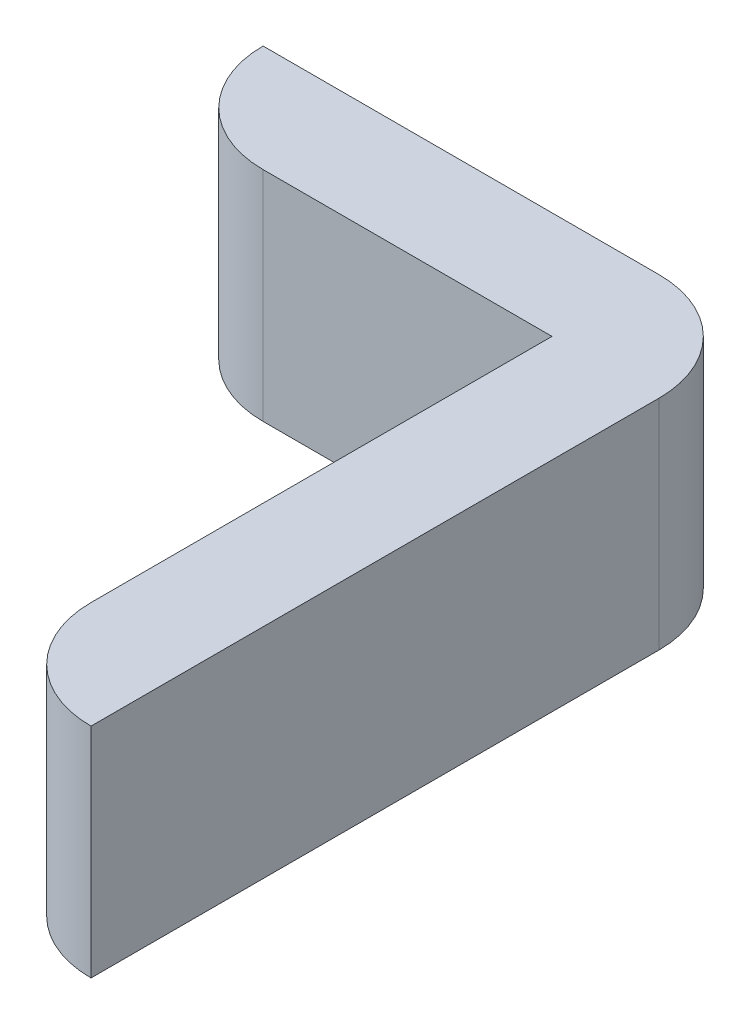
ISO-10303-21;
HEADER;
FILE_DESCRIPTION(('STEP AP214'),'2;1');
FILE_NAME('part.step','',(''),(''),'','','');
FILE_SCHEMA(('AUTOMOTIVE_DESIGN { 1 0 10303 214 1 1 1 1 }'));
ENDSEC;
DATA;
#1=APPLICATION_CONTEXT('core data for automotive mechanical design processes');
#2=APPLICATION_PROTOCOL_DEFINITION('international standard','automotive_design',2000,#1);
#3=PRODUCT_CONTEXT('',#1,'mechanical');
#4=PRODUCT('Part','Part','',(#3));
#5=PRODUCT_RELATED_PRODUCT_CATEGORY('part','',(#4));
#6=PRODUCT_DEFINITION_FORMATION('','',#4);
#7=PRODUCT_DEFINITION_CONTEXT('part definition',#1,'design');
#8=PRODUCT_DEFINITION('design','',#6,#7);
#9=PRODUCT_DEFINITION_SHAPE('','',#8);
#10=(LENGTH_UNIT() NAMED_UNIT(*) SI_UNIT(.MILLI.,.METRE.));
#11=(NAMED_UNIT(*) PLANE_ANGLE_UNIT() SI_UNIT($,.RADIAN.));
#12=(NAMED_UNIT(*) SI_UNIT($,.STERADIAN.) SOLID_ANGLE_UNIT());
#13=UNCERTAINTY_MEASURE_WITH_UNIT(LENGTH_MEASURE(1.E-05),#10,'distance_accuracy_value','');
#14=(GEOMETRIC_REPRESENTATION_CONTEXT(3) GLOBAL_UNCERTAINTY_ASSIGNED_CONTEXT((#13)) GLOBAL_UNIT_ASSIGNED_CONTEXT((#10,
#11,#12)) REPRESENTATION_CONTEXT('',''));
#15=CARTESIAN_POINT('',(0.,0.,0.));
#16=DIRECTION('',(0.,0.,1.));
#17=DIRECTION('',(1.,0.,0.));
#18=AXIS2_PLACEMENT_3D('',#15,#16,#17);
#19=CARTESIAN_POINT('',(-0.125,0.2548,0.));
#20=DIRECTION('',(0.,-1.,0.));
#21=DIRECTION('',(0.,0.,-1.));
#22=AXIS2_PLACEMENT_3D('',#19,#20,#21);
#23=PLANE('',#22);
#24=DIRECTION('',(-1.,0.,0.));
#25=VECTOR('',#24,1.);
#26=CARTESIAN_POINT('',(0.125,0.2548,0.25));
#27=LINE('',#26,#25);
#28=CARTESIAN_POINT('',(0.125,0.2548,0.25));
#29=VERTEX_POINT('',#28);
#30=CARTESIAN_POINT('',(0.8,0.2548,0.25));
#31=VERTEX_POINT('',#30);
#32=EDGE_CURVE('E102',#29,#31,#27,.F.);
#33=ORIENTED_EDGE('',*,*,#32,.T.);
#34=DIRECTION('',(0.,0.,-1.));
#35=VECTOR('',#34,1.);
#36=CARTESIAN_POINT('',(0.8,0.2548,0.25));
#37=LINE('',#36,#35);
#38=CARTESIAN_POINT('',(0.8,0.2548,1.327));
#39=VERTEX_POINT('',#38);
#40=EDGE_CURVE('E108',#31,#39,#37,.F.);
#41=ORIENTED_EDGE('',*,*,#40,.T.);
#42=CARTESIAN_POINT('',(1.05,0.2548,1.327));
#43=DIRECTION('',(0.,-1.,0.));
#44=DIRECTION('',(0.,0.,-1.));
#45=AXIS2_PLACEMENT_3D('',#42,#43,#44);
#46=CIRCLE('',#45,0.25);
#47=CARTESIAN_POINT('',(1.05,0.2548,1.577));
#48=VERTEX_POINT('',#47);
#49=EDGE_CURVE('E80',#48,#39,#46,.T.);
#50=ORIENTED_EDGE('',*,*,#49,.F.);
#51=DIRECTION('',(0.,0.,1.));
#52=VECTOR('',#51,1.);
#53=CARTESIAN_POINT('',(1.05,0.2548,1.577));
#54=LINE('',#53,#52);
#55=CARTESIAN_POINT('',(1.05,0.2548,0.25));
#56=VERTEX_POINT('',#55);
#57=EDGE_CURVE('E75',#48,#56,#54,.F.);
#58=ORIENTED_EDGE('',*,*,#57,.T.);
#59=CARTESIAN_POINT('',(0.8,0.2548,0.25));
#60=DIRECTION('',(0.,-1.,0.));
#61=DIRECTION('',(0.,0.,-1.));
#62=AXIS2_PLACEMENT_3D('',#59,#60,#61);
#63=CIRCLE('',#62,0.25);
#64=CARTESIAN_POINT('',(0.8,0.2548,0.));
#65=VERTEX_POINT('',#64);
#66=EDGE_CURVE('E19',#65,#56,#63,.T.);
#67=ORIENTED_EDGE('',*,*,#66,.F.);
#68=DIRECTION('',(1.,0.,0.));
#69=VECTOR('',#68,1.);
#70=CARTESIAN_POINT('',(0.8,0.2548,0.));
#71=LINE('',#70,#69);
#72=CARTESIAN_POINT('',(-0.125,0.2548,0.));
#73=VERTEX_POINT('',#72);
#74=EDGE_CURVE('E70',#65,#73,#71,.F.);
#75=ORIENTED_EDGE('',*,*,#74,.T.);
#76=CARTESIAN_POINT('',(0.125,0.2548,0.));
#77=DIRECTION('',(0.,-1.,0.));
#78=DIRECTION('',(0.,0.,-1.));
#79=AXIS2_PLACEMENT_3D('',#76,#77,#78);
#80=CIRCLE('',#79,0.25);
#81=EDGE_CURVE('E121',#29,#73,#80,.T.);
#82=ORIENTED_EDGE('',*,*,#81,.F.);
#83=EDGE_LOOP('',(#33,#41,#50,#58,#67,#75,#82));
#84=FACE_BOUND('',#83,.T.);
#85=ADVANCED_FACE('F16',(#84),#23,.F.);
#86=CARTESIAN_POINT('',(0.8,-0.2548,0.));
#87=DIRECTION('',(0.,0.,1.));
#88=DIRECTION('',(1.,0.,0.));
#89=AXIS2_PLACEMENT_3D('',#86,#87,#88);
#90=PLANE('',#89);
#91=DIRECTION('',(0.,-1.,0.));
#92=VECTOR('',#91,1.);
#93=CARTESIAN_POINT('',(-0.125,-0.2548,0.));
#94=LINE('',#93,#92);
#95=CARTESIAN_POINT('',(-0.125,-0.2548,0.));
#96=VERTEX_POINT('',#95);
#97=EDGE_CURVE('E123',#73,#96,#94,.T.);
#98=ORIENTED_EDGE('',*,*,#97,.F.);
#99=ORIENTED_EDGE('',*,*,#74,.F.);
#100=DIRECTION('',(0.,-1.,0.));
#101=VECTOR('',#100,1.);
#102=CARTESIAN_POINT('',(0.8,-0.2548,0.));
#103=LINE('',#102,#101);
#104=CARTESIAN_POINT('',(0.8,-0.2548,0.));
#105=VERTEX_POINT('',#104);
#106=EDGE_CURVE('E92',#105,#65,#103,.F.);
#107=ORIENTED_EDGE('',*,*,#106,.F.);
#108=DIRECTION('',(1.,0.,0.));
#109=VECTOR('',#108,1.);
#110=CARTESIAN_POINT('',(-0.125,-0.2548,0.));
#111=LINE('',#110,#109);
#112=EDGE_CURVE('E120',#96,#105,#111,.T.);
#113=ORIENTED_EDGE('',*,*,#112,.F.);
#114=EDGE_LOOP('',(#98,#99,#107,#113));
#115=FACE_BOUND('',#114,.T.);
#116=ADVANCED_FACE('F158',(#115),#90,.F.);
#117=CARTESIAN_POINT('',(0.8,-0.2548,0.25));
#118=DIRECTION('',(0.,-1.,0.));
#119=DIRECTION('',(0.,0.,-1.));
#120=AXIS2_PLACEMENT_3D('',#117,#118,#119);
#121=CYLINDRICAL_SURFACE('',#120,0.25);
#122=ORIENTED_EDGE('',*,*,#66,.T.);
#123=DIRECTION('',(0.,1.,0.));
#124=VECTOR('',#123,1.);
#125=CARTESIAN_POINT('',(1.05,-0.2548,0.25));
#126=LINE('',#125,#124);
#127=CARTESIAN_POINT('',(1.05,-0.2548,0.25));
#128=VERTEX_POINT('',#127);
#129=EDGE_CURVE('E86',#56,#128,#126,.F.);
#130=ORIENTED_EDGE('',*,*,#129,.T.);
#131=CARTESIAN_POINT('',(0.8,-0.2548,0.25));
#132=DIRECTION('',(0.,-1.,0.));
#133=DIRECTION('',(0.,0.,-1.));
#134=AXIS2_PLACEMENT_3D('',#131,#132,#133);
#135=CIRCLE('',#134,0.25);
#136=EDGE_CURVE('E118',#105,#128,#135,.T.);
#137=ORIENTED_EDGE('',*,*,#136,.F.);
#138=ORIENTED_EDGE('',*,*,#106,.T.);
#139=EDGE_LOOP('',(#122,#130,#137,#138));
#140=FACE_BOUND('',#139,.T.);
#141=ADVANCED_FACE('F89',(#140),#121,.T.);
#142=CARTESIAN_POINT('',(1.05,-0.2548,1.577));
#143=DIRECTION('',(-1.,0.,0.));
#144=DIRECTION('',(0.,0.,1.));
#145=AXIS2_PLACEMENT_3D('',#142,#143,#144);
#146=PLANE('',#145);
#147=DIRECTION('',(0.,-1.,0.));
#148=VECTOR('',#147,1.);
#149=CARTESIAN_POINT('',(1.05,-0.2548,1.577));
#150=LINE('',#149,#148);
#151=CARTESIAN_POINT('',(1.05,-0.2548,1.577));
#152=VERTEX_POINT('',#151);
#153=EDGE_CURVE('E85',#152,#48,#150,.F.);
#154=ORIENTED_EDGE('',*,*,#153,.F.);
#155=DIRECTION('',(0.,0.,-1.));
#156=VECTOR('',#155,1.);
#157=CARTESIAN_POINT('',(1.05,-0.2548,0.));
#158=LINE('',#157,#156);
#159=EDGE_CURVE('E94',#128,#152,#158,.F.);
#160=ORIENTED_EDGE('',*,*,#159,.F.);
#161=ORIENTED_EDGE('',*,*,#129,.F.);
#162=ORIENTED_EDGE('',*,*,#57,.F.);
#163=EDGE_LOOP('',(#154,#160,#161,#162));
#164=FACE_BOUND('',#163,.T.);
#165=ADVANCED_FACE('F93',(#164),#146,.F.);
#166=CARTESIAN_POINT('',(1.05,-0.2548,1.327));
#167=DIRECTION('',(0.,-1.,0.));
#168=DIRECTION('',(0.,0.,-1.));
#169=AXIS2_PLACEMENT_3D('',#166,#167,#168);
#170=CYLINDRICAL_SURFACE('',#169,0.25);
#171=ORIENTED_EDGE('',*,*,#49,.T.);
#172=DIRECTION('',(0.,1.,0.));
#173=VECTOR('',#172,1.);
#174=CARTESIAN_POINT('',(0.8,-0.2548,1.327));
#175=LINE('',#174,#173);
#176=CARTESIAN_POINT('',(0.8,-0.2548,1.327));
#177=VERTEX_POINT('',#176);
#178=EDGE_CURVE('E105',#39,#177,#175,.F.);
#179=ORIENTED_EDGE('',*,*,#178,.T.);
#180=CARTESIAN_POINT('',(1.05,-0.2548,1.327));
#181=DIRECTION('',(0.,-1.,0.));
#182=DIRECTION('',(0.,0.,-1.));
#183=AXIS2_PLACEMENT_3D('',#180,#181,#182);
#184=CIRCLE('',#183,0.25);
#185=EDGE_CURVE('E114',#152,#177,#184,.T.);
#186=ORIENTED_EDGE('',*,*,#185,.F.);
#187=ORIENTED_EDGE('',*,*,#153,.T.);
#188=EDGE_LOOP('',(#171,#179,#186,#187));
#189=FACE_BOUND('',#188,.T.);
#190=ADVANCED_FACE('F127',(#189),#170,.T.);
#191=CARTESIAN_POINT('',(0.8,-0.2548,0.25));
#192=DIRECTION('',(1.,0.,0.));
#193=DIRECTION('',(0.,0.,-1.));
#194=AXIS2_PLACEMENT_3D('',#191,#192,#193);
#195=PLANE('',#194);
#196=ORIENTED_EDGE('',*,*,#178,.F.);
#197=ORIENTED_EDGE('',*,*,#40,.F.);
#198=DIRECTION('',(0.,1.,0.));
#199=VECTOR('',#198,1.);
#200=CARTESIAN_POINT('',(0.8,-0.2548,0.25));
#201=LINE('',#200,#199);
#202=CARTESIAN_POINT('',(0.8,-0.2548,0.25));
#203=VERTEX_POINT('',#202);
#204=EDGE_CURVE('E104',#31,#203,#201,.F.);
#205=ORIENTED_EDGE('',*,*,#204,.T.);
#206=DIRECTION('',(0.,0.,-1.));
#207=VECTOR('',#206,1.);
#208=CARTESIAN_POINT('',(0.8,-0.2548,0.));
#209=LINE('',#208,#207);
#210=EDGE_CURVE('E117',#177,#203,#209,.T.);
#211=ORIENTED_EDGE('',*,*,#210,.F.);
#212=EDGE_LOOP('',(#196,#197,#205,#211));
#213=FACE_BOUND('',#212,.T.);
#214=ADVANCED_FACE('F150',(#213),#195,.F.);
#215=CARTESIAN_POINT('',(0.125,-0.2548,0.25));
#216=DIRECTION('',(0.,0.,-1.));
#217=DIRECTION('',(-1.,0.,0.));
#218=AXIS2_PLACEMENT_3D('',#215,#216,#217);
#219=PLANE('',#218);
#220=ORIENTED_EDGE('',*,*,#204,.F.);
#221=ORIENTED_EDGE('',*,*,#32,.F.);
#222=DIRECTION('',(0.,-1.,0.));
#223=VECTOR('',#222,1.);
#224=CARTESIAN_POINT('',(0.125,-0.2548,0.25));
#225=LINE('',#224,#223);
#226=CARTESIAN_POINT('',(0.125,-0.2548,0.25));
#227=VERTEX_POINT('',#226);
#228=EDGE_CURVE('E34',#227,#29,#225,.F.);
#229=ORIENTED_EDGE('',*,*,#228,.F.);
#230=DIRECTION('',(1.,0.,0.));
#231=VECTOR('',#230,1.);
#232=CARTESIAN_POINT('',(-0.125,-0.2548,0.25));
#233=LINE('',#232,#231);
#234=EDGE_CURVE('E25',#203,#227,#233,.F.);
#235=ORIENTED_EDGE('',*,*,#234,.F.);
#236=EDGE_LOOP('',(#220,#221,#229,#235));
#237=FACE_BOUND('',#236,.T.);
#238=ADVANCED_FACE('F151',(#237),#219,.F.);
#239=CARTESIAN_POINT('',(0.125,-0.2548,0.));
#240=DIRECTION('',(0.,-1.,0.));
#241=DIRECTION('',(0.,0.,-1.));
#242=AXIS2_PLACEMENT_3D('',#239,#240,#241);
#243=CYLINDRICAL_SURFACE('',#242,0.25);
#244=ORIENTED_EDGE('',*,*,#81,.T.);
#245=ORIENTED_EDGE('',*,*,#97,.T.);
#246=CARTESIAN_POINT('',(0.125,-0.2548,0.));
#247=DIRECTION('',(0.,-1.,0.));
#248=DIRECTION('',(0.,0.,-1.));
#249=AXIS2_PLACEMENT_3D('',#246,#247,#248);
#250=CIRCLE('',#249,0.25);
#251=EDGE_CURVE('E11',#227,#96,#250,.T.);
#252=ORIENTED_EDGE('',*,*,#251,.F.);
#253=ORIENTED_EDGE('',*,*,#228,.T.);
#254=EDGE_LOOP('',(#244,#245,#252,#253));
#255=FACE_BOUND('',#254,.T.);
#256=ADVANCED_FACE('F156',(#255),#243,.T.);
#257=CARTESIAN_POINT('',(-0.125,-0.2548,0.));
#258=DIRECTION('',(0.,-1.,0.));
#259=DIRECTION('',(0.,0.,-1.));
#260=AXIS2_PLACEMENT_3D('',#257,#258,#259);
#261=PLANE('',#260);
#262=ORIENTED_EDGE('',*,*,#234,.T.);
#263=ORIENTED_EDGE('',*,*,#251,.T.);
#264=ORIENTED_EDGE('',*,*,#112,.T.);
#265=ORIENTED_EDGE('',*,*,#136,.T.);
#266=ORIENTED_EDGE('',*,*,#159,.T.);
#267=ORIENTED_EDGE('',*,*,#185,.T.);
#268=ORIENTED_EDGE('',*,*,#210,.T.);
#269=EDGE_LOOP('',(#262,#263,#264,#265,#266,#267,#268));
#270=FACE_BOUND('',#269,.T.);
#271=ADVANCED_FACE('F132',(#270),#261,.T.);
#272=CLOSED_SHELL('',(#85,#116,#141,#165,#190,#214,#238,#256,#271));
#273=MANIFOLD_SOLID_BREP('B1',#272);
#274=ADVANCED_BREP_SHAPE_REPRESENTATION('',(#18,#273),#14);
#275=SHAPE_DEFINITION_REPRESENTATION(#9,#274);
ENDSEC;
END-ISO-10303-21;
